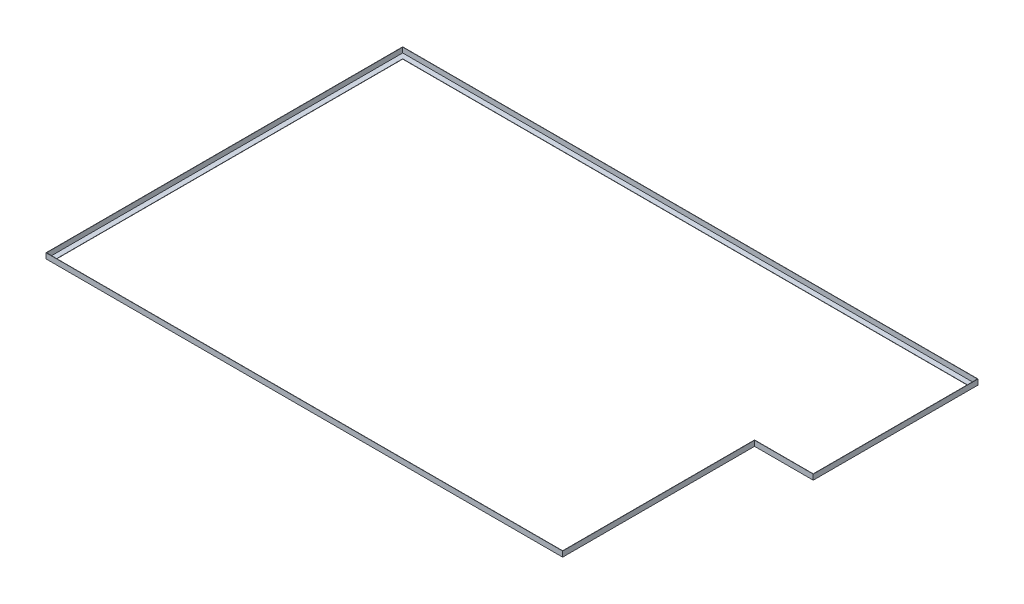
ISO-10303-21;
HEADER;
FILE_DESCRIPTION(('STEP AP214'),'2;1');
FILE_NAME('part.step','',(''),(''),'','','');
FILE_SCHEMA(('AUTOMOTIVE_DESIGN { 1 0 10303 214 1 1 1 1 }'));
ENDSEC;
DATA;
#1=APPLICATION_CONTEXT('core data for automotive mechanical design processes');
#2=APPLICATION_PROTOCOL_DEFINITION('international standard','automotive_design',2000,#1);
#3=PRODUCT_CONTEXT('',#1,'mechanical');
#4=PRODUCT('Part','Part','',(#3));
#5=PRODUCT_RELATED_PRODUCT_CATEGORY('part','',(#4));
#6=PRODUCT_DEFINITION_FORMATION('','',#4);
#7=PRODUCT_DEFINITION_CONTEXT('part definition',#1,'design');
#8=PRODUCT_DEFINITION('design','',#6,#7);
#9=PRODUCT_DEFINITION_SHAPE('','',#8);
#10=(LENGTH_UNIT() NAMED_UNIT(*) SI_UNIT(.MILLI.,.METRE.));
#11=(NAMED_UNIT(*) PLANE_ANGLE_UNIT() SI_UNIT($,.RADIAN.));
#12=(NAMED_UNIT(*) SI_UNIT($,.STERADIAN.) SOLID_ANGLE_UNIT());
#13=UNCERTAINTY_MEASURE_WITH_UNIT(LENGTH_MEASURE(1.E-05),#10,'distance_accuracy_value','');
#14=(GEOMETRIC_REPRESENTATION_CONTEXT(3) GLOBAL_UNCERTAINTY_ASSIGNED_CONTEXT((#13)) GLOBAL_UNIT_ASSIGNED_CONTEXT((#10,
#11,#12)) REPRESENTATION_CONTEXT('',''));
#15=CARTESIAN_POINT('',(0.,0.,0.));
#16=DIRECTION('',(0.,0.,1.));
#17=DIRECTION('',(1.,0.,0.));
#18=AXIS2_PLACEMENT_3D('',#15,#16,#17);
#19=CARTESIAN_POINT('',(1334.27958009608,1.27,-50.8));
#20=DIRECTION('',(0.,0.,1.));
#21=DIRECTION('',(1.,0.,0.));
#22=AXIS2_PLACEMENT_3D('',#19,#20,#21);
#23=PLANE('',#22);
#24=DIRECTION('',(-1.,0.,0.));
#25=VECTOR('',#24,1.);
#26=CARTESIAN_POINT('',(1334.27958009608,1.27,-50.8));
#27=LINE('',#26,#25);
#28=CARTESIAN_POINT('',(1282.23677124726,1.27,-50.7999999999999));
#29=VERTEX_POINT('',#28);
#30=CARTESIAN_POINT('',(1002.83677124726,1.27,-50.8));
#31=VERTEX_POINT('',#30);
#32=EDGE_CURVE('E170',#29,#31,#27,.T.);
#33=ORIENTED_EDGE('',*,*,#32,.F.);
#34=DIRECTION('',(0.,-1.,0.));
#35=VECTOR('',#34,1.);
#36=CARTESIAN_POINT('',(1282.23677124726,1.27,-50.7999999999998));
#37=LINE('',#36,#35);
#38=CARTESIAN_POINT('',(1282.23677124726,0.,-50.8));
#39=VERTEX_POINT('',#38);
#40=EDGE_CURVE('E200',#29,#39,#37,.T.);
#41=ORIENTED_EDGE('',*,*,#40,.T.);
#42=DIRECTION('',(-1.,0.,0.));
#43=VECTOR('',#42,1.);
#44=CARTESIAN_POINT('',(1334.27958009608,0.,-50.8));
#45=LINE('',#44,#43);
#46=CARTESIAN_POINT('',(1002.83677124726,0.,-50.8));
#47=VERTEX_POINT('',#46);
#48=EDGE_CURVE('E172',#39,#47,#45,.T.);
#49=ORIENTED_EDGE('',*,*,#48,.T.);
#50=DIRECTION('',(0.,-1.,0.));
#51=VECTOR('',#50,1.);
#52=CARTESIAN_POINT('',(1002.83677124726,1.27,-50.8));
#53=LINE('',#52,#51);
#54=EDGE_CURVE('E149',#31,#47,#53,.T.);
#55=ORIENTED_EDGE('',*,*,#54,.F.);
#56=EDGE_LOOP('',(#33,#41,#49,#55));
#57=FACE_BOUND('',#56,.T.);
#58=ADVANCED_FACE('F36',(#57),#23,.F.);
#59=CARTESIAN_POINT('',(1334.27958009608,25.4,-25.3999999999999));
#60=DIRECTION('',(0.,0.,-1.));
#61=DIRECTION('',(-1.,0.,0.));
#62=AXIS2_PLACEMENT_3D('',#59,#60,#61);
#63=PLANE('',#62);
#64=DIRECTION('',(-1.,0.,0.));
#65=VECTOR('',#64,1.);
#66=CARTESIAN_POINT('',(1334.27958009608,0.,-25.3999999999999));
#67=LINE('',#66,#65);
#68=CARTESIAN_POINT('',(1307.63677124726,0.,-25.3999999999999));
#69=VERTEX_POINT('',#68);
#70=CARTESIAN_POINT('',(1028.23677124726,0.,-25.3999999999999));
#71=VERTEX_POINT('',#70);
#72=EDGE_CURVE('E175',#69,#71,#67,.T.);
#73=ORIENTED_EDGE('',*,*,#72,.F.);
#74=DIRECTION('',(0.,1.,0.));
#75=VECTOR('',#74,1.);
#76=CARTESIAN_POINT('',(1307.63677124726,25.4,-25.4));
#77=LINE('',#76,#75);
#78=CARTESIAN_POINT('',(1307.63677124726,25.4,-25.4));
#79=VERTEX_POINT('',#78);
#80=EDGE_CURVE('E235',#69,#79,#77,.T.);
#81=ORIENTED_EDGE('',*,*,#80,.T.);
#82=DIRECTION('',(-1.,0.,0.));
#83=VECTOR('',#82,1.);
#84=CARTESIAN_POINT('',(1334.27958009608,25.4,-25.3999999999999));
#85=LINE('',#84,#83);
#86=CARTESIAN_POINT('',(1028.23677124726,25.4,-25.3999999999999));
#87=VERTEX_POINT('',#86);
#88=EDGE_CURVE('E177',#79,#87,#85,.T.);
#89=ORIENTED_EDGE('',*,*,#88,.T.);
#90=DIRECTION('',(0.,1.,0.));
#91=VECTOR('',#90,1.);
#92=CARTESIAN_POINT('',(1028.23677124726,25.4,-25.4));
#93=LINE('',#92,#91);
#94=EDGE_CURVE('E132',#71,#87,#93,.T.);
#95=ORIENTED_EDGE('',*,*,#94,.F.);
#96=EDGE_LOOP('',(#73,#81,#89,#95));
#97=FACE_BOUND('',#96,.T.);
#98=ADVANCED_FACE('F258',(#97),#63,.F.);
#99=CARTESIAN_POINT('',(1334.27958009608,25.4,-26.6699999999999));
#100=DIRECTION('',(0.,0.,1.));
#101=DIRECTION('',(1.,0.,0.));
#102=AXIS2_PLACEMENT_3D('',#99,#100,#101);
#103=PLANE('',#102);
#104=DIRECTION('',(-1.,0.,0.));
#105=VECTOR('',#104,1.);
#106=CARTESIAN_POINT('',(1334.27958009608,25.4,-26.6699999999999));
#107=LINE('',#106,#105);
#108=CARTESIAN_POINT('',(1306.36677124726,25.4,-26.6699999999999));
#109=VERTEX_POINT('',#108);
#110=CARTESIAN_POINT('',(1026.96677124726,25.4,-26.67));
#111=VERTEX_POINT('',#110);
#112=EDGE_CURVE('E156',#109,#111,#107,.T.);
#113=ORIENTED_EDGE('',*,*,#112,.F.);
#114=DIRECTION('',(0.,-1.,0.));
#115=VECTOR('',#114,1.);
#116=CARTESIAN_POINT('',(1306.36677124726,25.4,-26.6699999999999));
#117=LINE('',#116,#115);
#118=CARTESIAN_POINT('',(1306.36677124726,1.27,-26.6699999999999));
#119=VERTEX_POINT('',#118);
#120=EDGE_CURVE('E153',#109,#119,#117,.T.);
#121=ORIENTED_EDGE('',*,*,#120,.T.);
#122=DIRECTION('',(-1.,0.,0.));
#123=VECTOR('',#122,1.);
#124=CARTESIAN_POINT('',(1334.27958009608,1.27,-26.6699999999999));
#125=LINE('',#124,#123);
#126=CARTESIAN_POINT('',(1026.96677124726,1.27,-26.67));
#127=VERTEX_POINT('',#126);
#128=EDGE_CURVE('E39',#119,#127,#125,.T.);
#129=ORIENTED_EDGE('',*,*,#128,.T.);
#130=DIRECTION('',(0.,-1.,0.));
#131=VECTOR('',#130,1.);
#132=CARTESIAN_POINT('',(1026.96677124726,25.4,-26.6700000000001));
#133=LINE('',#132,#131);
#134=EDGE_CURVE('E139',#111,#127,#133,.T.);
#135=ORIENTED_EDGE('',*,*,#134,.F.);
#136=EDGE_LOOP('',(#113,#121,#129,#135));
#137=FACE_BOUND('',#136,.T.);
#138=ADVANCED_FACE('F152',(#137),#103,.F.);
#139=CARTESIAN_POINT('',(1002.83677124726,1.27,-56.1042808848824));
#140=DIRECTION('',(1.,0.,0.));
#141=DIRECTION('',(0.,0.,-1.));
#142=AXIS2_PLACEMENT_3D('',#139,#140,#141);
#143=PLANE('',#142);
#144=DIRECTION('',(0.,0.,1.));
#145=VECTOR('',#144,1.);
#146=CARTESIAN_POINT('',(1002.83677124726,1.27,-56.1042808848824));
#147=LINE('',#146,#145);
#148=CARTESIAN_POINT('',(1002.83677124726,1.27,863.6));
#149=VERTEX_POINT('',#148);
#150=EDGE_CURVE('E202',#31,#149,#147,.T.);
#151=ORIENTED_EDGE('',*,*,#150,.F.);
#152=ORIENTED_EDGE('',*,*,#54,.T.);
#153=DIRECTION('',(0.,0.,1.));
#154=VECTOR('',#153,1.);
#155=CARTESIAN_POINT('',(1002.83677124726,0.,-56.1042808848824));
#156=LINE('',#155,#154);
#157=CARTESIAN_POINT('',(1002.83677124726,0.,863.6));
#158=VERTEX_POINT('',#157);
#159=EDGE_CURVE('E205',#47,#158,#156,.T.);
#160=ORIENTED_EDGE('',*,*,#159,.T.);
#161=DIRECTION('',(0.,-1.,0.));
#162=VECTOR('',#161,1.);
#163=CARTESIAN_POINT('',(1002.83677124726,1.27,863.6));
#164=LINE('',#163,#162);
#165=EDGE_CURVE('E305',#149,#158,#164,.T.);
#166=ORIENTED_EDGE('',*,*,#165,.F.);
#167=EDGE_LOOP('',(#151,#152,#160,#166));
#168=FACE_BOUND('',#167,.T.);
#169=ADVANCED_FACE('F388',(#168),#143,.F.);
#170=CARTESIAN_POINT('',(1028.23677124726,25.4,-56.1042808848824));
#171=DIRECTION('',(-1.,0.,0.));
#172=DIRECTION('',(0.,0.,1.));
#173=AXIS2_PLACEMENT_3D('',#170,#171,#172);
#174=PLANE('',#173);
#175=DIRECTION('',(0.,0.,1.));
#176=VECTOR('',#175,1.);
#177=CARTESIAN_POINT('',(1028.23677124726,0.,-56.1042808848824));
#178=LINE('',#177,#176);
#179=CARTESIAN_POINT('',(1028.23677124726,0.,889.));
#180=VERTEX_POINT('',#179);
#181=EDGE_CURVE('E208',#71,#180,#178,.T.);
#182=ORIENTED_EDGE('',*,*,#181,.F.);
#183=ORIENTED_EDGE('',*,*,#94,.T.);
#184=DIRECTION('',(0.,0.,1.));
#185=VECTOR('',#184,1.);
#186=CARTESIAN_POINT('',(1028.23677124726,25.4,-56.1042808848824));
#187=LINE('',#186,#185);
#188=CARTESIAN_POINT('',(1028.23677124726,25.4,889.));
#189=VERTEX_POINT('',#188);
#190=EDGE_CURVE('E166',#87,#189,#187,.T.);
#191=ORIENTED_EDGE('',*,*,#190,.T.);
#192=DIRECTION('',(0.,1.,0.));
#193=VECTOR('',#192,1.);
#194=CARTESIAN_POINT('',(1028.23677124726,25.4,889.));
#195=LINE('',#194,#193);
#196=EDGE_CURVE('E213',#180,#189,#195,.T.);
#197=ORIENTED_EDGE('',*,*,#196,.F.);
#198=EDGE_LOOP('',(#182,#183,#191,#197));
#199=FACE_BOUND('',#198,.T.);
#200=ADVANCED_FACE('F212',(#199),#174,.F.);
#201=CARTESIAN_POINT('',(1026.96677124726,25.4,-56.1042808848824));
#202=DIRECTION('',(1.,0.,0.));
#203=DIRECTION('',(0.,0.,-1.));
#204=AXIS2_PLACEMENT_3D('',#201,#202,#203);
#205=PLANE('',#204);
#206=DIRECTION('',(0.,0.,1.));
#207=VECTOR('',#206,1.);
#208=CARTESIAN_POINT('',(1026.96677124726,25.4,-56.1042808848824));
#209=LINE('',#208,#207);
#210=CARTESIAN_POINT('',(1026.96677124726,25.4,887.73));
#211=VERTEX_POINT('',#210);
#212=EDGE_CURVE('E146',#111,#211,#209,.T.);
#213=ORIENTED_EDGE('',*,*,#212,.F.);
#214=ORIENTED_EDGE('',*,*,#134,.T.);
#215=DIRECTION('',(0.,0.,1.));
#216=VECTOR('',#215,1.);
#217=CARTESIAN_POINT('',(1026.96677124726,1.27,-56.1042808848824));
#218=LINE('',#217,#216);
#219=CARTESIAN_POINT('',(1026.96677124726,1.27,887.73));
#220=VERTEX_POINT('',#219);
#221=EDGE_CURVE('E144',#127,#220,#218,.T.);
#222=ORIENTED_EDGE('',*,*,#221,.T.);
#223=DIRECTION('',(0.,-1.,0.));
#224=VECTOR('',#223,1.);
#225=CARTESIAN_POINT('',(1026.96677124726,25.4,887.73));
#226=LINE('',#225,#224);
#227=EDGE_CURVE('E238',#211,#220,#226,.T.);
#228=ORIENTED_EDGE('',*,*,#227,.F.);
#229=EDGE_LOOP('',(#213,#214,#222,#228));
#230=FACE_BOUND('',#229,.T.);
#231=ADVANCED_FACE('F141',(#230),#205,.F.);
#232=CARTESIAN_POINT('',(1282.23677124726,1.27,-836.957191151177));
#233=DIRECTION('',(1.,0.,0.));
#234=DIRECTION('',(0.,0.,-1.));
#235=AXIS2_PLACEMENT_3D('',#232,#233,#234);
#236=PLANE('',#235);
#237=DIRECTION('',(0.,0.,1.));
#238=VECTOR('',#237,1.);
#239=CARTESIAN_POINT('',(1282.23677124726,1.27,-836.957191151177));
#240=LINE('',#239,#238);
#241=CARTESIAN_POINT('',(1282.23677124726,1.27,-784.914382302355));
#242=VERTEX_POINT('',#241);
#243=EDGE_CURVE('E161',#242,#29,#240,.T.);
#244=ORIENTED_EDGE('',*,*,#243,.F.);
#245=DIRECTION('',(0.,-1.,0.));
#246=VECTOR('',#245,1.);
#247=CARTESIAN_POINT('',(1282.23677124726,1.27,-784.914382302354));
#248=LINE('',#247,#246);
#249=CARTESIAN_POINT('',(1282.23677124726,0.,-784.914382302355));
#250=VERTEX_POINT('',#249);
#251=EDGE_CURVE('E286',#242,#250,#248,.T.);
#252=ORIENTED_EDGE('',*,*,#251,.T.);
#253=DIRECTION('',(0.,0.,1.));
#254=VECTOR('',#253,1.);
#255=CARTESIAN_POINT('',(1282.23677124726,0.,-836.957191151177));
#256=LINE('',#255,#254);
#257=EDGE_CURVE('E164',#250,#39,#256,.T.);
#258=ORIENTED_EDGE('',*,*,#257,.T.);
#259=ORIENTED_EDGE('',*,*,#40,.F.);
#260=EDGE_LOOP('',(#244,#252,#258,#259));
#261=FACE_BOUND('',#260,.T.);
#262=ADVANCED_FACE('F390',(#261),#236,.F.);
#263=CARTESIAN_POINT('',(1307.63677124726,25.4,-836.957191151177));
#264=DIRECTION('',(-1.,0.,0.));
#265=DIRECTION('',(0.,0.,1.));
#266=AXIS2_PLACEMENT_3D('',#263,#264,#265);
#267=PLANE('',#266);
#268=DIRECTION('',(0.,0.,1.));
#269=VECTOR('',#268,1.);
#270=CARTESIAN_POINT('',(1307.63677124726,0.,-836.957191151177));
#271=LINE('',#270,#269);
#272=CARTESIAN_POINT('',(1307.63677124726,0.,-810.314382302354));
#273=VERTEX_POINT('',#272);
#274=EDGE_CURVE('E195',#273,#69,#271,.T.);
#275=ORIENTED_EDGE('',*,*,#274,.F.);
#276=DIRECTION('',(0.,1.,0.));
#277=VECTOR('',#276,1.);
#278=CARTESIAN_POINT('',(1307.63677124726,25.4,-810.314382302354));
#279=LINE('',#278,#277);
#280=CARTESIAN_POINT('',(1307.63677124726,25.4,-810.314382302354));
#281=VERTEX_POINT('',#280);
#282=EDGE_CURVE('E255',#273,#281,#279,.T.);
#283=ORIENTED_EDGE('',*,*,#282,.T.);
#284=DIRECTION('',(0.,0.,1.));
#285=VECTOR('',#284,1.);
#286=CARTESIAN_POINT('',(1307.63677124726,25.4,-836.957191151177));
#287=LINE('',#286,#285);
#288=EDGE_CURVE('E191',#281,#79,#287,.T.);
#289=ORIENTED_EDGE('',*,*,#288,.T.);
#290=ORIENTED_EDGE('',*,*,#80,.F.);
#291=EDGE_LOOP('',(#275,#283,#289,#290));
#292=FACE_BOUND('',#291,.T.);
#293=ADVANCED_FACE('F254',(#292),#267,.F.);
#294=CARTESIAN_POINT('',(1306.36677124726,25.4,-836.957191151177));
#295=DIRECTION('',(1.,0.,0.));
#296=DIRECTION('',(0.,0.,-1.));
#297=AXIS2_PLACEMENT_3D('',#294,#295,#296);
#298=PLANE('',#297);
#299=DIRECTION('',(0.,0.,1.));
#300=VECTOR('',#299,1.);
#301=CARTESIAN_POINT('',(1306.36677124726,25.4,-836.957191151177));
#302=LINE('',#301,#300);
#303=CARTESIAN_POINT('',(1306.36677124726,25.4,-809.044382302355));
#304=VERTEX_POINT('',#303);
#305=EDGE_CURVE('E185',#304,#109,#302,.T.);
#306=ORIENTED_EDGE('',*,*,#305,.F.);
#307=DIRECTION('',(0.,-1.,0.));
#308=VECTOR('',#307,1.);
#309=CARTESIAN_POINT('',(1306.36677124726,25.4,-809.044382302355));
#310=LINE('',#309,#308);
#311=CARTESIAN_POINT('',(1306.36677124726,1.27,-809.044382302355));
#312=VERTEX_POINT('',#311);
#313=EDGE_CURVE('E289',#304,#312,#310,.T.);
#314=ORIENTED_EDGE('',*,*,#313,.T.);
#315=DIRECTION('',(0.,0.,1.));
#316=VECTOR('',#315,1.);
#317=CARTESIAN_POINT('',(1306.36677124726,1.27,-836.957191151177));
#318=LINE('',#317,#316);
#319=EDGE_CURVE('E190',#312,#119,#318,.T.);
#320=ORIENTED_EDGE('',*,*,#319,.T.);
#321=ORIENTED_EDGE('',*,*,#120,.F.);
#322=EDGE_LOOP('',(#306,#314,#320,#321));
#323=FACE_BOUND('',#322,.T.);
#324=ADVANCED_FACE('F397',(#323),#298,.F.);
#325=CARTESIAN_POINT('',(1054.87958009608,1.27,863.6));
#326=DIRECTION('',(0.,0.,1.));
#327=DIRECTION('',(1.,0.,0.));
#328=AXIS2_PLACEMENT_3D('',#325,#326,#327);
#329=PLANE('',#328);
#330=DIRECTION('',(-1.,0.,0.));
#331=VECTOR('',#330,1.);
#332=CARTESIAN_POINT('',(1054.87958009608,1.27,863.6));
#333=LINE('',#332,#331);
#334=CARTESIAN_POINT('',(-1407.6776110551,1.27,863.6));
#335=VERTEX_POINT('',#334);
#336=EDGE_CURVE('E304',#149,#335,#333,.T.);
#337=ORIENTED_EDGE('',*,*,#336,.F.);
#338=ORIENTED_EDGE('',*,*,#165,.T.);
#339=DIRECTION('',(-1.,0.,0.));
#340=VECTOR('',#339,1.);
#341=CARTESIAN_POINT('',(1054.87958009608,0.,863.6));
#342=LINE('',#341,#340);
#343=CARTESIAN_POINT('',(-1407.6776110551,0.,863.6));
#344=VERTEX_POINT('',#343);
#345=EDGE_CURVE('E229',#158,#344,#342,.T.);
#346=ORIENTED_EDGE('',*,*,#345,.T.);
#347=DIRECTION('',(0.,-1.,0.));
#348=VECTOR('',#347,1.);
#349=CARTESIAN_POINT('',(-1407.6776110551,1.27,863.6));
#350=LINE('',#349,#348);
#351=EDGE_CURVE('E269',#335,#344,#350,.T.);
#352=ORIENTED_EDGE('',*,*,#351,.F.);
#353=EDGE_LOOP('',(#337,#338,#346,#352));
#354=FACE_BOUND('',#353,.T.);
#355=ADVANCED_FACE('F315',(#354),#329,.F.);
#356=CARTESIAN_POINT('',(1054.87958009608,25.4,889.));
#357=DIRECTION('',(0.,0.,-1.));
#358=DIRECTION('',(-1.,0.,0.));
#359=AXIS2_PLACEMENT_3D('',#356,#357,#358);
#360=PLANE('',#359);
#361=DIRECTION('',(-1.,0.,0.));
#362=VECTOR('',#361,1.);
#363=CARTESIAN_POINT('',(1054.87958009608,0.,889.));
#364=LINE('',#363,#362);
#365=CARTESIAN_POINT('',(-1433.0776110551,0.,889.));
#366=VERTEX_POINT('',#365);
#367=EDGE_CURVE('E225',#180,#366,#364,.T.);
#368=ORIENTED_EDGE('',*,*,#367,.F.);
#369=ORIENTED_EDGE('',*,*,#196,.T.);
#370=DIRECTION('',(-1.,0.,0.));
#371=VECTOR('',#370,1.);
#372=CARTESIAN_POINT('',(1054.87958009608,25.4,889.));
#373=LINE('',#372,#371);
#374=CARTESIAN_POINT('',(-1433.0776110551,25.4,889.));
#375=VERTEX_POINT('',#374);
#376=EDGE_CURVE('E217',#189,#375,#373,.T.);
#377=ORIENTED_EDGE('',*,*,#376,.T.);
#378=DIRECTION('',(0.,1.,0.));
#379=VECTOR('',#378,1.);
#380=CARTESIAN_POINT('',(-1433.0776110551,25.4,889.));
#381=LINE('',#380,#379);
#382=EDGE_CURVE('E266',#366,#375,#381,.T.);
#383=ORIENTED_EDGE('',*,*,#382,.F.);
#384=EDGE_LOOP('',(#368,#369,#377,#383));
#385=FACE_BOUND('',#384,.T.);
#386=ADVANCED_FACE('F267',(#385),#360,.F.);
#387=CARTESIAN_POINT('',(1054.87958009608,25.4,887.73));
#388=DIRECTION('',(0.,0.,1.));
#389=DIRECTION('',(1.,0.,0.));
#390=AXIS2_PLACEMENT_3D('',#387,#388,#389);
#391=PLANE('',#390);
#392=DIRECTION('',(-1.,0.,0.));
#393=VECTOR('',#392,1.);
#394=CARTESIAN_POINT('',(1054.87958009608,25.4,887.73));
#395=LINE('',#394,#393);
#396=CARTESIAN_POINT('',(-1431.8076110551,25.4,887.73));
#397=VERTEX_POINT('',#396);
#398=EDGE_CURVE('E224',#211,#397,#395,.T.);
#399=ORIENTED_EDGE('',*,*,#398,.F.);
#400=ORIENTED_EDGE('',*,*,#227,.T.);
#401=DIRECTION('',(-1.,0.,0.));
#402=VECTOR('',#401,1.);
#403=CARTESIAN_POINT('',(1054.87958009608,1.27,887.73));
#404=LINE('',#403,#402);
#405=CARTESIAN_POINT('',(-1431.8076110551,1.27,887.73));
#406=VERTEX_POINT('',#405);
#407=EDGE_CURVE('E160',#220,#406,#404,.T.);
#408=ORIENTED_EDGE('',*,*,#407,.T.);
#409=DIRECTION('',(0.,-1.,0.));
#410=VECTOR('',#409,1.);
#411=CARTESIAN_POINT('',(-1431.8076110551,25.4,887.73));
#412=LINE('',#411,#410);
#413=EDGE_CURVE('E270',#397,#406,#412,.T.);
#414=ORIENTED_EDGE('',*,*,#413,.F.);
#415=EDGE_LOOP('',(#399,#400,#408,#414));
#416=FACE_BOUND('',#415,.T.);
#417=ADVANCED_FACE('F345',(#416),#391,.F.);
#418=CARTESIAN_POINT('',(-1459.72041990392,1.27,-784.914382302355));
#419=DIRECTION('',(0.,0.,-1.));
#420=DIRECTION('',(-1.,0.,0.));
#421=AXIS2_PLACEMENT_3D('',#418,#419,#420);
#422=PLANE('',#421);
#423=DIRECTION('',(1.,0.,0.));
#424=VECTOR('',#423,1.);
#425=CARTESIAN_POINT('',(-1459.72041990392,1.27,-784.914382302355));
#426=LINE('',#425,#424);
#427=CARTESIAN_POINT('',(-1407.6776110551,1.27,-784.914382302355));
#428=VERTEX_POINT('',#427);
#429=EDGE_CURVE('E234',#428,#242,#426,.T.);
#430=ORIENTED_EDGE('',*,*,#429,.F.);
#431=DIRECTION('',(0.,-1.,0.));
#432=VECTOR('',#431,1.);
#433=CARTESIAN_POINT('',(-1407.6776110551,1.27,-784.914382302355));
#434=LINE('',#433,#432);
#435=CARTESIAN_POINT('',(-1407.6776110551,0.,-784.914382302354));
#436=VERTEX_POINT('',#435);
#437=EDGE_CURVE('E328',#428,#436,#434,.T.);
#438=ORIENTED_EDGE('',*,*,#437,.T.);
#439=DIRECTION('',(1.,0.,0.));
#440=VECTOR('',#439,1.);
#441=CARTESIAN_POINT('',(-1459.72041990392,0.,-784.914382302355));
#442=LINE('',#441,#440);
#443=EDGE_CURVE('E292',#436,#250,#442,.T.);
#444=ORIENTED_EDGE('',*,*,#443,.T.);
#445=ORIENTED_EDGE('',*,*,#251,.F.);
#446=EDGE_LOOP('',(#430,#438,#444,#445));
#447=FACE_BOUND('',#446,.T.);
#448=ADVANCED_FACE('F356',(#447),#422,.F.);
#449=CARTESIAN_POINT('',(-1459.72041990392,25.4,-810.314382302355));
#450=DIRECTION('',(0.,0.,1.));
#451=DIRECTION('',(1.,0.,0.));
#452=AXIS2_PLACEMENT_3D('',#449,#450,#451);
#453=PLANE('',#452);
#454=DIRECTION('',(1.,0.,0.));
#455=VECTOR('',#454,1.);
#456=CARTESIAN_POINT('',(-1459.72041990392,0.,-810.314382302355));
#457=LINE('',#456,#455);
#458=CARTESIAN_POINT('',(-1433.0776110551,0.,-810.314382302355));
#459=VERTEX_POINT('',#458);
#460=EDGE_CURVE('E251',#459,#273,#457,.T.);
#461=ORIENTED_EDGE('',*,*,#460,.F.);
#462=DIRECTION('',(0.,1.,0.));
#463=VECTOR('',#462,1.);
#464=CARTESIAN_POINT('',(-1433.0776110551,25.4,-810.314382302355));
#465=LINE('',#464,#463);
#466=CARTESIAN_POINT('',(-1433.0776110551,25.4,-810.314382302354));
#467=VERTEX_POINT('',#466);
#468=EDGE_CURVE('E275',#459,#467,#465,.T.);
#469=ORIENTED_EDGE('',*,*,#468,.T.);
#470=DIRECTION('',(1.,0.,0.));
#471=VECTOR('',#470,1.);
#472=CARTESIAN_POINT('',(-1459.72041990392,25.4,-810.314382302355));
#473=LINE('',#472,#471);
#474=EDGE_CURVE('E296',#467,#281,#473,.T.);
#475=ORIENTED_EDGE('',*,*,#474,.T.);
#476=ORIENTED_EDGE('',*,*,#282,.F.);
#477=EDGE_LOOP('',(#461,#469,#475,#476));
#478=FACE_BOUND('',#477,.T.);
#479=ADVANCED_FACE('F354',(#478),#453,.F.);
#480=CARTESIAN_POINT('',(-1459.72041990392,25.4,-809.044382302355));
#481=DIRECTION('',(0.,0.,-1.));
#482=DIRECTION('',(-1.,0.,0.));
#483=AXIS2_PLACEMENT_3D('',#480,#481,#482);
#484=PLANE('',#483);
#485=DIRECTION('',(1.,0.,0.));
#486=VECTOR('',#485,1.);
#487=CARTESIAN_POINT('',(-1459.72041990392,25.4,-809.044382302355));
#488=LINE('',#487,#486);
#489=CARTESIAN_POINT('',(-1431.8076110551,25.4,-809.044382302355));
#490=VERTEX_POINT('',#489);
#491=EDGE_CURVE('E187',#490,#304,#488,.T.);
#492=ORIENTED_EDGE('',*,*,#491,.F.);
#493=DIRECTION('',(0.,-1.,0.));
#494=VECTOR('',#493,1.);
#495=CARTESIAN_POINT('',(-1431.8076110551,25.4,-809.044382302355));
#496=LINE('',#495,#494);
#497=CARTESIAN_POINT('',(-1431.8076110551,1.27,-809.044382302355));
#498=VERTEX_POINT('',#497);
#499=EDGE_CURVE('E53',#490,#498,#496,.T.);
#500=ORIENTED_EDGE('',*,*,#499,.T.);
#501=DIRECTION('',(1.,0.,0.));
#502=VECTOR('',#501,1.);
#503=CARTESIAN_POINT('',(-1459.72041990392,1.27,-809.044382302355));
#504=LINE('',#503,#502);
#505=EDGE_CURVE('E299',#498,#312,#504,.T.);
#506=ORIENTED_EDGE('',*,*,#505,.T.);
#507=ORIENTED_EDGE('',*,*,#313,.F.);
#508=EDGE_LOOP('',(#492,#500,#506,#507));
#509=FACE_BOUND('',#508,.T.);
#510=ADVANCED_FACE('F347',(#509),#484,.F.);
#511=CARTESIAN_POINT('',(-1431.8076110551,1.27,915.642808848822));
#512=DIRECTION('',(0.,-1.,0.));
#513=DIRECTION('',(0.,0.,-1.));
#514=AXIS2_PLACEMENT_3D('',#511,#512,#513);
#515=PLANE('',#514);
#516=ORIENTED_EDGE('',*,*,#32,.T.);
#517=ORIENTED_EDGE('',*,*,#150,.T.);
#518=ORIENTED_EDGE('',*,*,#336,.T.);
#519=DIRECTION('',(0.,0.,-1.));
#520=VECTOR('',#519,1.);
#521=CARTESIAN_POINT('',(-1407.6776110551,1.27,915.642808848822));
#522=LINE('',#521,#520);
#523=EDGE_CURVE('E280',#335,#428,#522,.T.);
#524=ORIENTED_EDGE('',*,*,#523,.T.);
#525=ORIENTED_EDGE('',*,*,#429,.T.);
#526=ORIENTED_EDGE('',*,*,#243,.T.);
#527=EDGE_LOOP('',(#516,#517,#518,#524,#525,#526));
#528=FACE_BOUND('',#527,.T.);
#529=DIRECTION('',(0.,0.,-1.));
#530=VECTOR('',#529,1.);
#531=CARTESIAN_POINT('',(-1431.8076110551,1.27,915.642808848822));
#532=LINE('',#531,#530);
#533=EDGE_CURVE('E11',#406,#498,#532,.T.);
#534=ORIENTED_EDGE('',*,*,#533,.F.);
#535=ORIENTED_EDGE('',*,*,#407,.F.);
#536=ORIENTED_EDGE('',*,*,#221,.F.);
#537=ORIENTED_EDGE('',*,*,#128,.F.);
#538=ORIENTED_EDGE('',*,*,#319,.F.);
#539=ORIENTED_EDGE('',*,*,#505,.F.);
#540=EDGE_LOOP('',(#534,#535,#536,#537,#538,#539));
#541=FACE_BOUND('',#540,.T.);
#542=ADVANCED_FACE('F158',(#528,#541),#515,.F.);
#543=CARTESIAN_POINT('',(-1407.6776110551,1.27,915.642808848822));
#544=DIRECTION('',(-1.,0.,0.));
#545=DIRECTION('',(0.,0.,1.));
#546=AXIS2_PLACEMENT_3D('',#543,#544,#545);
#547=PLANE('',#546);
#548=ORIENTED_EDGE('',*,*,#351,.T.);
#549=DIRECTION('',(0.,0.,-1.));
#550=VECTOR('',#549,1.);
#551=CARTESIAN_POINT('',(-1407.6776110551,0.,915.642808848822));
#552=LINE('',#551,#550);
#553=EDGE_CURVE('E276',#344,#436,#552,.T.);
#554=ORIENTED_EDGE('',*,*,#553,.T.);
#555=ORIENTED_EDGE('',*,*,#437,.F.);
#556=ORIENTED_EDGE('',*,*,#523,.F.);
#557=EDGE_LOOP('',(#548,#554,#555,#556));
#558=FACE_BOUND('',#557,.T.);
#559=ADVANCED_FACE('F327',(#558),#547,.F.);
#560=CARTESIAN_POINT('',(-1433.0776110551,0.,915.642808848822));
#561=DIRECTION('',(0.,1.,0.));
#562=DIRECTION('',(-1.,0.,0.));
#563=AXIS2_PLACEMENT_3D('',#560,#561,#562);
#564=PLANE('',#563);
#565=ORIENTED_EDGE('',*,*,#72,.T.);
#566=ORIENTED_EDGE('',*,*,#181,.T.);
#567=ORIENTED_EDGE('',*,*,#367,.T.);
#568=DIRECTION('',(0.,0.,-1.));
#569=VECTOR('',#568,1.);
#570=CARTESIAN_POINT('',(-1433.0776110551,0.,915.642808848822));
#571=LINE('',#570,#569);
#572=EDGE_CURVE('E262',#366,#459,#571,.T.);
#573=ORIENTED_EDGE('',*,*,#572,.T.);
#574=ORIENTED_EDGE('',*,*,#460,.T.);
#575=ORIENTED_EDGE('',*,*,#274,.T.);
#576=EDGE_LOOP('',(#565,#566,#567,#573,#574,#575));
#577=FACE_BOUND('',#576,.T.);
#578=ORIENTED_EDGE('',*,*,#553,.F.);
#579=ORIENTED_EDGE('',*,*,#345,.F.);
#580=ORIENTED_EDGE('',*,*,#159,.F.);
#581=ORIENTED_EDGE('',*,*,#48,.F.);
#582=ORIENTED_EDGE('',*,*,#257,.F.);
#583=ORIENTED_EDGE('',*,*,#443,.F.);
#584=EDGE_LOOP('',(#578,#579,#580,#581,#582,#583));
#585=FACE_BOUND('',#584,.T.);
#586=ADVANCED_FACE('F246',(#577,#585),#564,.F.);
#587=CARTESIAN_POINT('',(-1433.0776110551,25.4,915.642808848822));
#588=DIRECTION('',(1.,0.,0.));
#589=DIRECTION('',(0.,0.,-1.));
#590=AXIS2_PLACEMENT_3D('',#587,#588,#589);
#591=PLANE('',#590);
#592=ORIENTED_EDGE('',*,*,#382,.T.);
#593=DIRECTION('',(0.,0.,-1.));
#594=VECTOR('',#593,1.);
#595=CARTESIAN_POINT('',(-1433.0776110551,25.4,915.642808848822));
#596=LINE('',#595,#594);
#597=EDGE_CURVE('E221',#375,#467,#596,.T.);
#598=ORIENTED_EDGE('',*,*,#597,.T.);
#599=ORIENTED_EDGE('',*,*,#468,.F.);
#600=ORIENTED_EDGE('',*,*,#572,.F.);
#601=EDGE_LOOP('',(#592,#598,#599,#600));
#602=FACE_BOUND('',#601,.T.);
#603=ADVANCED_FACE('F273',(#602),#591,.F.);
#604=CARTESIAN_POINT('',(-1433.0776110551,25.4,915.642808848822));
#605=DIRECTION('',(0.,-1.,0.));
#606=DIRECTION('',(1.,0.,0.));
#607=AXIS2_PLACEMENT_3D('',#604,#605,#606);
#608=PLANE('',#607);
#609=ORIENTED_EDGE('',*,*,#112,.T.);
#610=ORIENTED_EDGE('',*,*,#212,.T.);
#611=ORIENTED_EDGE('',*,*,#398,.T.);
#612=DIRECTION('',(0.,0.,-1.));
#613=VECTOR('',#612,1.);
#614=CARTESIAN_POINT('',(-1431.8076110551,25.4,915.642808848822));
#615=LINE('',#614,#613);
#616=EDGE_CURVE('E45',#397,#490,#615,.T.);
#617=ORIENTED_EDGE('',*,*,#616,.T.);
#618=ORIENTED_EDGE('',*,*,#491,.T.);
#619=ORIENTED_EDGE('',*,*,#305,.T.);
#620=EDGE_LOOP('',(#609,#610,#611,#617,#618,#619));
#621=FACE_BOUND('',#620,.T.);
#622=ORIENTED_EDGE('',*,*,#597,.F.);
#623=ORIENTED_EDGE('',*,*,#376,.F.);
#624=ORIENTED_EDGE('',*,*,#190,.F.);
#625=ORIENTED_EDGE('',*,*,#88,.F.);
#626=ORIENTED_EDGE('',*,*,#288,.F.);
#627=ORIENTED_EDGE('',*,*,#474,.F.);
#628=EDGE_LOOP('',(#622,#623,#624,#625,#626,#627));
#629=FACE_BOUND('',#628,.T.);
#630=ADVANCED_FACE('F180',(#621,#629),#608,.F.);
#631=CARTESIAN_POINT('',(-1431.8076110551,25.4,915.642808848822));
#632=DIRECTION('',(-1.,0.,0.));
#633=DIRECTION('',(0.,0.,1.));
#634=AXIS2_PLACEMENT_3D('',#631,#632,#633);
#635=PLANE('',#634);
#636=ORIENTED_EDGE('',*,*,#413,.T.);
#637=ORIENTED_EDGE('',*,*,#533,.T.);
#638=ORIENTED_EDGE('',*,*,#499,.F.);
#639=ORIENTED_EDGE('',*,*,#616,.F.);
#640=EDGE_LOOP('',(#636,#637,#638,#639));
#641=FACE_BOUND('',#640,.T.);
#642=ADVANCED_FACE('F341',(#641),#635,.F.);
#643=CLOSED_SHELL('',(#58,#98,#138,#169,#200,#231,#262,#293,#324,#355,#386,#417,#448,#479,#510,
#542,#559,#586,#603,#630,#642));
#644=MANIFOLD_SOLID_BREP('B2',#643);
#645=ADVANCED_BREP_SHAPE_REPRESENTATION('',(#18,#644),#14);
#646=SHAPE_DEFINITION_REPRESENTATION(#9,#645);
ENDSEC;
END-ISO-10303-21;
